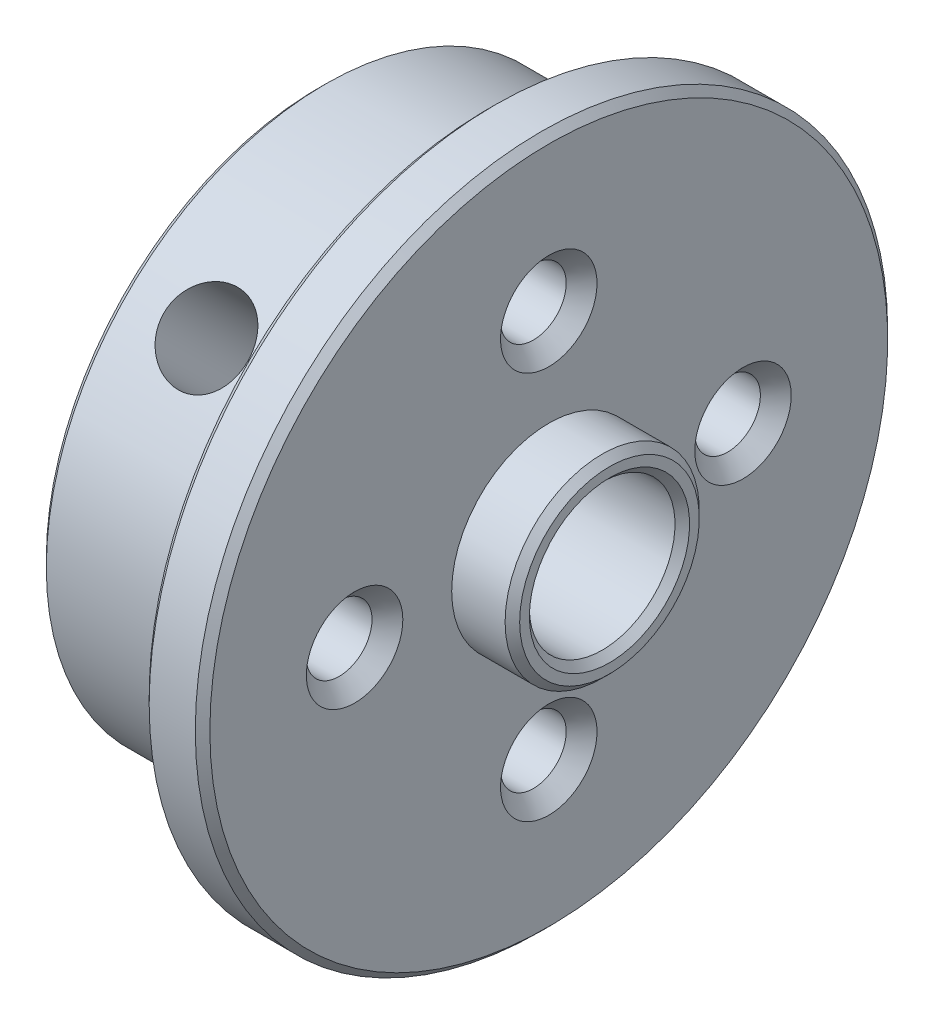
ISO-10303-21;
HEADER;
FILE_DESCRIPTION(('STEP AP214'),'2;1');
FILE_NAME('part.step','',(''),(''),'','','');
FILE_SCHEMA(('AUTOMOTIVE_DESIGN { 1 0 10303 214 1 1 1 1 }'));
ENDSEC;
DATA;
#1=APPLICATION_CONTEXT('core data for automotive mechanical design processes');
#2=APPLICATION_PROTOCOL_DEFINITION('international standard','automotive_design',2000,#1);
#3=PRODUCT_CONTEXT('',#1,'mechanical');
#4=PRODUCT('Part','Part','',(#3));
#5=PRODUCT_RELATED_PRODUCT_CATEGORY('part','',(#4));
#6=PRODUCT_DEFINITION_FORMATION('','',#4);
#7=PRODUCT_DEFINITION_CONTEXT('part definition',#1,'design');
#8=PRODUCT_DEFINITION('design','',#6,#7);
#9=PRODUCT_DEFINITION_SHAPE('','',#8);
#10=(LENGTH_UNIT() NAMED_UNIT(*) SI_UNIT(.MILLI.,.METRE.));
#11=(NAMED_UNIT(*) PLANE_ANGLE_UNIT() SI_UNIT($,.RADIAN.));
#12=(NAMED_UNIT(*) SI_UNIT($,.STERADIAN.) SOLID_ANGLE_UNIT());
#13=UNCERTAINTY_MEASURE_WITH_UNIT(LENGTH_MEASURE(1.E-05),#10,'distance_accuracy_value','');
#14=(GEOMETRIC_REPRESENTATION_CONTEXT(3) GLOBAL_UNCERTAINTY_ASSIGNED_CONTEXT((#13)) GLOBAL_UNIT_ASSIGNED_CONTEXT((#10,
#11,#12)) REPRESENTATION_CONTEXT('',''));
#15=CARTESIAN_POINT('',(0.,0.,0.));
#16=DIRECTION('',(0.,0.,1.));
#17=DIRECTION('',(1.,0.,0.));
#18=AXIS2_PLACEMENT_3D('',#15,#16,#17);
#19=CARTESIAN_POINT('',(0.,0.,0.));
#20=DIRECTION('',(-1.,0.,0.));
#21=DIRECTION('',(0.,0.,1.));
#22=AXIS2_PLACEMENT_3D('',#19,#20,#21);
#23=CYLINDRICAL_SURFACE('',#22,11.5);
#24=CARTESIAN_POINT('',(-9.19999999999999,0.,0.));
#25=DIRECTION('',(1.,0.,0.));
#26=DIRECTION('',(0.,0.,-1.));
#27=AXIS2_PLACEMENT_3D('',#24,#25,#26);
#28=CIRCLE('',#27,11.5);
#29=CARTESIAN_POINT('',(-9.19999999999999,0.,-11.5));
#30=VERTEX_POINT('',#29);
#31=EDGE_CURVE('E74',#30,#30,#28,.T.);
#32=ORIENTED_EDGE('',*,*,#31,.T.);
#33=EDGE_LOOP('',(#32));
#34=FACE_BOUND('',#33,.T.);
#35=CARTESIAN_POINT('',(-6.,6.81817458415801,9.26080424908883));
#36=CARTESIAN_POINT('',(-6.09642872764414,6.81817854052005,9.26080257448462));
#37=CARTESIAN_POINT('',(-6.19291339372761,6.8247808689419,9.2559516418585));
#38=CARTESIAN_POINT('',(-6.38318501015113,6.85093575108356,9.23660834611285));
#39=CARTESIAN_POINT('',(-6.47696923765206,6.87050092878717,9.22210658438797));
#40=CARTESIAN_POINT('',(-6.65905830324152,6.9217672746644,9.18368972584961));
#41=CARTESIAN_POINT('',(-6.74736729025288,6.95345911982339,9.15978186007717));
#42=CARTESIAN_POINT('',(-6.91612250146382,7.0277303954712,9.10292165669288));
#43=CARTESIAN_POINT('',(-6.99656980389278,7.07030833002896,9.0699705617266));
#44=CARTESIAN_POINT('',(-7.14797616114338,7.16510434376142,8.99527303043986));
#45=CARTESIAN_POINT('',(-7.21886296662692,7.21738942421794,8.95346516067613));
#46=CARTESIAN_POINT('',(-7.34851000060077,7.32951048541137,8.86191311272266));
#47=CARTESIAN_POINT('',(-7.40726956176326,7.38934688138393,8.81216849806331));
#48=CARTESIAN_POINT('',(-7.5112607451004,7.51480317326911,8.70543154314447));
#49=CARTESIAN_POINT('',(-7.55642583052685,7.5804495433012,8.64840544040237));
#50=CARTESIAN_POINT('',(-7.63151899232104,7.71506272430739,8.52853562820631));
#51=CARTESIAN_POINT('',(-7.66144787578985,7.78402935918657,8.46569222711816));
#52=CARTESIAN_POINT('',(-7.70500003067391,7.92252153425317,8.33622015234762));
#53=CARTESIAN_POINT('',(-7.71874428717648,7.99203896540362,8.26962351544998));
#54=CARTESIAN_POINT('',(-7.72991271218585,8.13001649549902,8.13401412124361));
#55=CARTESIAN_POINT('',(-7.72733779014373,8.1984766531516,8.06500149878844));
#56=CARTESIAN_POINT('',(-7.70603641544544,8.33184546073385,7.92713567360147));
#57=CARTESIAN_POINT('',(-7.68744012478527,8.39677826017712,7.85828565828065));
#58=CARTESIAN_POINT('',(-7.63482821321521,8.52201622930709,7.72229177081329));
#59=CARTESIAN_POINT('',(-7.60081219462002,8.58232127959409,7.65514794271764));
#60=CARTESIAN_POINT('',(-7.51819320731742,8.69713409078544,7.5244575289156));
#61=CARTESIAN_POINT('',(-7.46953545558073,8.75161901936677,7.46092553752131));
#62=CARTESIAN_POINT('',(-7.35905421677062,8.85341663204186,7.33984200058632));
#63=CARTESIAN_POINT('',(-7.29722986087831,8.9007288424798,7.28229085007381));
#64=CARTESIAN_POINT('',(-7.16144531959408,8.9877465578854,7.17462612799933));
#65=CARTESIAN_POINT('',(-7.08737149152437,9.02737246580495,7.12459148130544));
#66=CARTESIAN_POINT('',(-6.92957675970303,9.09776185387514,7.03448708690798));
#67=CARTESIAN_POINT('',(-6.84585579626062,9.12852527918584,6.99441740086653));
#68=CARTESIAN_POINT('',(-6.67102633346322,9.18072205025259,6.92576443147103));
#69=CARTESIAN_POINT('',(-6.57991210654787,9.20214807887082,6.89719015770043));
#70=CARTESIAN_POINT('',(-6.39294600484399,9.23530020275009,6.85273714683321));
#71=CARTESIAN_POINT('',(-6.29709446535216,9.24702698346388,6.83685751260003));
#72=CARTESIAN_POINT('',(-6.10437197370602,9.26053522455062,6.8185495150189));
#73=CARTESIAN_POINT('',(-6.00751997647464,9.26241221291593,6.81599194968309));
#74=CARTESIAN_POINT('',(-5.81467357929608,9.25644992403591,6.82408668552968));
#75=CARTESIAN_POINT('',(-5.71867915276177,9.24861094907319,6.83473857574009));
#76=CARTESIAN_POINT('',(-5.53076527363405,9.22340054231299,6.86872053260736));
#77=CARTESIAN_POINT('',(-5.4388277801321,9.20607717223097,6.8919866714389));
#78=CARTESIAN_POINT('',(-5.26106853223601,9.16219097675006,6.95022143341502));
#79=CARTESIAN_POINT('',(-5.17524708083541,9.13562769398149,6.9851906358504));
#80=CARTESIAN_POINT('',(-5.01144379266514,9.07343118554275,7.06579419519126));
#81=CARTESIAN_POINT('',(-4.93352602027353,9.03773101187161,7.11150706209449));
#82=CARTESIAN_POINT('',(-4.7884005011324,8.95793582389579,7.21175985366466));
#83=CARTESIAN_POINT('',(-4.72119336199644,8.91384033363655,7.26630027876491));
#84=CARTESIAN_POINT('',(-4.59882607416581,8.81762377083518,7.38276729982356));
#85=CARTESIAN_POINT('',(-4.54377124370924,8.76543873697966,7.4447517872899));
#86=CARTESIAN_POINT('',(-4.44800518892195,8.65435505315604,7.57359646785078));
#87=CARTESIAN_POINT('',(-4.40729357137407,8.59545658729433,7.64045652722155));
#88=CARTESIAN_POINT('',(-4.34153782425449,8.47250151284391,7.77657322760843));
#89=CARTESIAN_POINT('',(-4.31643613713192,8.40846484856458,7.84582005863276));
#90=CARTESIAN_POINT('',(-4.28242653707968,8.27666178943879,7.98473738812657));
#91=CARTESIAN_POINT('',(-4.27351755177161,8.20889564188749,8.05440785823349));
#92=CARTESIAN_POINT('',(-4.27217247399859,8.07219814790684,8.19139116449172));
#93=CARTESIAN_POINT('',(-4.27957524530074,8.00328481405845,8.25872044815867));
#94=CARTESIAN_POINT('',(-4.3102981211562,7.86568100847884,8.38988080610632));
#95=CARTESIAN_POINT('',(-4.33361817439202,7.79699053602984,8.45371189166454));
#96=CARTESIAN_POINT('',(-4.39545642865356,7.66201652661834,8.57623527885114));
#97=CARTESIAN_POINT('',(-4.43396344459169,7.59573125738638,8.63493132361557));
#98=CARTESIAN_POINT('',(-4.52506534771602,7.46764933071558,8.74593647008587));
#99=CARTESIAN_POINT('',(-4.57766069462073,7.40585281983378,8.79824536329052));
#100=CARTESIAN_POINT('',(-4.69602877486753,7.28826170649499,8.89590618386379));
#101=CARTESIAN_POINT('',(-4.76192046740779,7.23252882901332,8.94118826367201));
#102=CARTESIAN_POINT('',(-4.90476056175067,7.12969845020847,9.02339989152853));
#103=CARTESIAN_POINT('',(-4.98171155490582,7.08260297865642,9.06032747676423));
#104=CARTESIAN_POINT('',(-5.14499573665775,6.99857227843254,9.1253950430916));
#105=CARTESIAN_POINT('',(-5.23137934689139,6.96169579365216,9.15348433734684));
#106=CARTESIAN_POINT('',(-5.41068881345844,6.89994280655271,9.20012499066084));
#107=CARTESIAN_POINT('',(-5.50360776834516,6.87505385690361,9.21868624454205));
#108=CARTESIAN_POINT('',(-5.66411942162941,6.84390952320254,9.24181492529233));
#109=CARTESIAN_POINT('',(-5.73072099340234,6.83427846937976,9.24892979328969));
#110=CARTESIAN_POINT('',(-5.86487256078978,6.82140965514164,9.25842501116616));
#111=CARTESIAN_POINT('',(-5.93242254405105,6.81817181153114,9.260805422655));
#112=CARTESIAN_POINT('',(-6.,6.81817458415801,9.26080424908883));
#113=B_SPLINE_CURVE_WITH_KNOTS('',3,(#35,#36,#37,#38,#39,#40,#41,#42,#43,#44,#45,#46,#47,#48,
#49,#50,#51,#52,#53,#54,#55,#56,#57,#58,#59,#60,#61,#62,#63,#64,#65,#66,#67,#68,#69,#70,#71,#72,
#73,#74,#75,#76,#77,#78,#79,#80,#81,#82,#83,#84,#85,#86,#87,#88,#89,#90,#91,#92,#93,#94,#95,#96,
#97,#98,#99,#100,#101,#102,#103,#104,#105,#106,#107,#108,#109,#110,#111,#112),.UNSPECIFIED.,.T.,
.F.,(4,2,2,2,2,2,2,2,2,2,2,2,2,2,2,2,2,2,2,2,2,2,2,2,2,2,2,2,2,2,2,2,2,2,2,2,2,2,4),(0.,
0.289039178024996,0.578360253933015,0.867459344477231,1.15651872929524,1.44765292141547,
1.73880312955476,2.03135599910802,2.32389336976538,2.61422976390469,2.90454997803691,
3.19253355704969,3.48052456377762,3.76960679710975,4.05870811189724,4.35065980511372,
4.6426133048519,4.93479518080975,5.22695640630195,5.51627880464328,5.80559220182495,
6.0934529075039,6.38132786412921,6.67137574885808,6.96144008213262,7.25392733400486,
7.54640656675625,7.83780086279367,8.12917586023968,8.41768541569528,8.7061940409975,
8.99449057740371,9.28279652240498,9.57380637237164,9.86488452162263,10.1576027734458,
10.4500164206944,10.6525783229463,10.8551375892325),.UNSPECIFIED.);
#114=CARTESIAN_POINT('',(-6.,6.81817458415801,9.26080424908883));
#115=VERTEX_POINT('',#114);
#116=EDGE_CURVE('E89',#115,#115,#113,.T.);
#117=ORIENTED_EDGE('',*,*,#116,.T.);
#118=EDGE_LOOP('',(#117));
#119=FACE_BOUND('',#118,.T.);
#120=CARTESIAN_POINT('',(-2.5,0.,0.));
#121=DIRECTION('',(-1.,0.,0.));
#122=DIRECTION('',(0.,0.,1.));
#123=AXIS2_PLACEMENT_3D('',#120,#121,#122);
#124=CIRCLE('',#123,11.5);
#125=CARTESIAN_POINT('',(-2.5,0.,11.5));
#126=VERTEX_POINT('',#125);
#127=EDGE_CURVE('E96',#126,#126,#124,.T.);
#128=ORIENTED_EDGE('',*,*,#127,.T.);
#129=EDGE_LOOP('',(#128));
#130=FACE_BOUND('',#129,.T.);
#131=ADVANCED_FACE('F45',(#34,#119,#130),#23,.T.);
#132=CARTESIAN_POINT('',(-9.5,3.,0.));
#133=DIRECTION('',(1.,0.,0.));
#134=DIRECTION('',(0.,0.,-1.));
#135=AXIS2_PLACEMENT_3D('',#132,#133,#134);
#136=PLANE('',#135);
#137=CARTESIAN_POINT('',(-9.5,0.,0.));
#138=DIRECTION('',(1.,0.,0.));
#139=DIRECTION('',(0.,0.,-1.));
#140=AXIS2_PLACEMENT_3D('',#137,#138,#139);
#141=CIRCLE('',#140,3.3);
#142=CARTESIAN_POINT('',(-9.5,0.,-3.3));
#143=VERTEX_POINT('',#142);
#144=EDGE_CURVE('E77',#143,#143,#141,.T.);
#145=ORIENTED_EDGE('',*,*,#144,.T.);
#146=EDGE_LOOP('',(#145));
#147=FACE_BOUND('',#146,.T.);
#148=CARTESIAN_POINT('',(-9.5,0.,0.));
#149=DIRECTION('',(1.,0.,0.));
#150=DIRECTION('',(0.,0.,-1.));
#151=AXIS2_PLACEMENT_3D('',#148,#149,#150);
#152=CIRCLE('',#151,11.2);
#153=CARTESIAN_POINT('',(-9.5,0.,-11.2));
#154=VERTEX_POINT('',#153);
#155=EDGE_CURVE('E80',#154,#154,#152,.F.);
#156=ORIENTED_EDGE('',*,*,#155,.T.);
#157=EDGE_LOOP('',(#156));
#158=FACE_BOUND('',#157,.T.);
#159=CARTESIAN_POINT('',(-9.5,8.,0.));
#160=DIRECTION('',(1.,0.,0.));
#161=DIRECTION('',(0.,0.,-1.));
#162=AXIS2_PLACEMENT_3D('',#159,#160,#161);
#163=CIRCLE('',#162,1.98755);
#164=CARTESIAN_POINT('',(-9.5,8.,-1.98755));
#165=VERTEX_POINT('',#164);
#166=EDGE_CURVE('E117',#165,#165,#163,.T.);
#167=ORIENTED_EDGE('',*,*,#166,.T.);
#168=EDGE_LOOP('',(#167));
#169=FACE_BOUND('',#168,.T.);
#170=CARTESIAN_POINT('',(-9.5,-8.,0.));
#171=DIRECTION('',(1.,0.,0.));
#172=DIRECTION('',(0.,0.,-1.));
#173=AXIS2_PLACEMENT_3D('',#170,#171,#172);
#174=CIRCLE('',#173,1.98755);
#175=CARTESIAN_POINT('',(-9.5,-8.,-1.98755));
#176=VERTEX_POINT('',#175);
#177=EDGE_CURVE('E197',#176,#176,#174,.T.);
#178=ORIENTED_EDGE('',*,*,#177,.T.);
#179=EDGE_LOOP('',(#178));
#180=FACE_BOUND('',#179,.T.);
#181=CARTESIAN_POINT('',(-9.5,0.,-8.));
#182=DIRECTION('',(1.,0.,0.));
#183=DIRECTION('',(0.,0.,-1.));
#184=AXIS2_PLACEMENT_3D('',#181,#182,#183);
#185=CIRCLE('',#184,1.98755);
#186=CARTESIAN_POINT('',(-9.5,0.,-9.98755));
#187=VERTEX_POINT('',#186);
#188=EDGE_CURVE('E185',#187,#187,#185,.T.);
#189=ORIENTED_EDGE('',*,*,#188,.T.);
#190=EDGE_LOOP('',(#189));
#191=FACE_BOUND('',#190,.T.);
#192=CARTESIAN_POINT('',(-9.5,0.,8.));
#193=DIRECTION('',(1.,0.,0.));
#194=DIRECTION('',(0.,0.,-1.));
#195=AXIS2_PLACEMENT_3D('',#192,#193,#194);
#196=CIRCLE('',#195,1.98755);
#197=CARTESIAN_POINT('',(-9.5,0.,6.01245));
#198=VERTEX_POINT('',#197);
#199=EDGE_CURVE('E173',#198,#198,#196,.T.);
#200=ORIENTED_EDGE('',*,*,#199,.T.);
#201=EDGE_LOOP('',(#200));
#202=FACE_BOUND('',#201,.T.);
#203=ADVANCED_FACE('F142',(#147,#158,#169,#180,#191,#202),#136,.F.);
#204=CARTESIAN_POINT('',(-2.5,14.2621,0.));
#205=DIRECTION('',(1.,0.,0.));
#206=DIRECTION('',(0.,0.,-1.));
#207=AXIS2_PLACEMENT_3D('',#204,#205,#206);
#208=PLANE('',#207);
#209=CARTESIAN_POINT('',(-2.5,0.,0.));
#210=DIRECTION('',(1.,0.,0.));
#211=DIRECTION('',(0.,0.,-1.));
#212=AXIS2_PLACEMENT_3D('',#209,#210,#211);
#213=CIRCLE('',#212,13.9621);
#214=CARTESIAN_POINT('',(-2.5,0.,-13.9621));
#215=VERTEX_POINT('',#214);
#216=EDGE_CURVE('E71',#215,#215,#213,.F.);
#217=ORIENTED_EDGE('',*,*,#216,.T.);
#218=EDGE_LOOP('',(#217));
#219=FACE_BOUND('',#218,.T.);
#220=ORIENTED_EDGE('',*,*,#127,.F.);
#221=EDGE_LOOP('',(#220));
#222=FACE_BOUND('',#221,.T.);
#223=ADVANCED_FACE('F139',(#219,#222),#208,.F.);
#224=CARTESIAN_POINT('',(0.,0.,0.));
#225=DIRECTION('',(-1.,0.,0.));
#226=DIRECTION('',(0.,0.,1.));
#227=AXIS2_PLACEMENT_3D('',#224,#225,#226);
#228=CYLINDRICAL_SURFACE('',#227,14.2621);
#229=CARTESIAN_POINT('',(-2.19999999999999,0.,0.));
#230=DIRECTION('',(1.,0.,0.));
#231=DIRECTION('',(0.,0.,-1.));
#232=AXIS2_PLACEMENT_3D('',#229,#230,#231);
#233=CIRCLE('',#232,14.2621);
#234=CARTESIAN_POINT('',(-2.19999999999999,0.,-14.2621));
#235=VERTEX_POINT('',#234);
#236=EDGE_CURVE('E65',#235,#235,#233,.T.);
#237=ORIENTED_EDGE('',*,*,#236,.T.);
#238=EDGE_LOOP('',(#237));
#239=FACE_BOUND('',#238,.T.);
#240=CARTESIAN_POINT('',(-0.3,0.,0.));
#241=DIRECTION('',(-1.,0.,0.));
#242=DIRECTION('',(0.,0.,1.));
#243=AXIS2_PLACEMENT_3D('',#240,#241,#242);
#244=CIRCLE('',#243,14.2621);
#245=CARTESIAN_POINT('',(-0.3,0.,14.2621));
#246=VERTEX_POINT('',#245);
#247=EDGE_CURVE('E68',#246,#246,#244,.T.);
#248=ORIENTED_EDGE('',*,*,#247,.T.);
#249=EDGE_LOOP('',(#248));
#250=FACE_BOUND('',#249,.T.);
#251=ADVANCED_FACE('F136',(#239,#250),#228,.T.);
#252=CARTESIAN_POINT('',(0.,14.2621,0.));
#253=DIRECTION('',(-1.,0.,0.));
#254=DIRECTION('',(0.,0.,1.));
#255=AXIS2_PLACEMENT_3D('',#252,#253,#254);
#256=PLANE('',#255);
#257=CARTESIAN_POINT('',(0.,0.,0.));
#258=DIRECTION('',(-1.,0.,0.));
#259=DIRECTION('',(0.,0.,1.));
#260=AXIS2_PLACEMENT_3D('',#257,#258,#259);
#261=CIRCLE('',#260,13.9621);
#262=CARTESIAN_POINT('',(0.,0.,13.9621));
#263=VERTEX_POINT('',#262);
#264=EDGE_CURVE('E60',#263,#263,#261,.F.);
#265=ORIENTED_EDGE('',*,*,#264,.T.);
#266=EDGE_LOOP('',(#265));
#267=FACE_BOUND('',#266,.T.);
#268=CARTESIAN_POINT('',(0.,8.,0.));
#269=DIRECTION('',(1.,0.,0.));
#270=DIRECTION('',(0.,0.,-1.));
#271=AXIS2_PLACEMENT_3D('',#268,#269,#270);
#272=CIRCLE('',#271,1.98755);
#273=CARTESIAN_POINT('',(0.,8.,-1.98755));
#274=VERTEX_POINT('',#273);
#275=EDGE_CURVE('E205',#274,#274,#272,.T.);
#276=ORIENTED_EDGE('',*,*,#275,.F.);
#277=EDGE_LOOP('',(#276));
#278=FACE_BOUND('',#277,.T.);
#279=CARTESIAN_POINT('',(0.,-8.,0.));
#280=DIRECTION('',(1.,0.,0.));
#281=DIRECTION('',(0.,0.,-1.));
#282=AXIS2_PLACEMENT_3D('',#279,#280,#281);
#283=CIRCLE('',#282,1.98755);
#284=CARTESIAN_POINT('',(0.,-8.,-1.98755));
#285=VERTEX_POINT('',#284);
#286=EDGE_CURVE('E194',#285,#285,#283,.T.);
#287=ORIENTED_EDGE('',*,*,#286,.F.);
#288=EDGE_LOOP('',(#287));
#289=FACE_BOUND('',#288,.T.);
#290=CARTESIAN_POINT('',(0.,0.,-8.));
#291=DIRECTION('',(1.,0.,0.));
#292=DIRECTION('',(0.,0.,-1.));
#293=AXIS2_PLACEMENT_3D('',#290,#291,#292);
#294=CIRCLE('',#293,1.98755);
#295=CARTESIAN_POINT('',(0.,0.,-9.98755));
#296=VERTEX_POINT('',#295);
#297=EDGE_CURVE('E182',#296,#296,#294,.T.);
#298=ORIENTED_EDGE('',*,*,#297,.F.);
#299=EDGE_LOOP('',(#298));
#300=FACE_BOUND('',#299,.T.);
#301=CARTESIAN_POINT('',(0.,0.,8.));
#302=DIRECTION('',(1.,0.,0.));
#303=DIRECTION('',(0.,0.,-1.));
#304=AXIS2_PLACEMENT_3D('',#301,#302,#303);
#305=CIRCLE('',#304,1.98755);
#306=CARTESIAN_POINT('',(0.,0.,6.01245));
#307=VERTEX_POINT('',#306);
#308=EDGE_CURVE('E170',#307,#307,#305,.T.);
#309=ORIENTED_EDGE('',*,*,#308,.F.);
#310=EDGE_LOOP('',(#309));
#311=FACE_BOUND('',#310,.T.);
#312=CARTESIAN_POINT('',(0.,0.,0.));
#313=DIRECTION('',(-1.,0.,0.));
#314=DIRECTION('',(0.,0.,1.));
#315=AXIS2_PLACEMENT_3D('',#312,#313,#314);
#316=CIRCLE('',#315,4.);
#317=CARTESIAN_POINT('',(0.,0.,4.));
#318=VERTEX_POINT('',#317);
#319=EDGE_CURVE('E159',#318,#318,#316,.T.);
#320=ORIENTED_EDGE('',*,*,#319,.T.);
#321=EDGE_LOOP('',(#320));
#322=FACE_BOUND('',#321,.T.);
#323=ADVANCED_FACE('F133',(#267,#278,#289,#300,#311,#322),#256,.F.);
#324=CARTESIAN_POINT('',(0.,0.,0.));
#325=DIRECTION('',(-1.,0.,0.));
#326=DIRECTION('',(0.,0.,1.));
#327=AXIS2_PLACEMENT_3D('',#324,#325,#326);
#328=CYLINDRICAL_SURFACE('',#327,4.);
#329=CARTESIAN_POINT('',(2.20000000000001,0.,0.));
#330=DIRECTION('',(-1.,0.,0.));
#331=DIRECTION('',(0.,0.,1.));
#332=AXIS2_PLACEMENT_3D('',#329,#330,#331);
#333=CIRCLE('',#332,4.);
#334=CARTESIAN_POINT('',(2.20000000000001,0.,4.));
#335=VERTEX_POINT('',#334);
#336=EDGE_CURVE('E12',#335,#335,#333,.T.);
#337=ORIENTED_EDGE('',*,*,#336,.T.);
#338=EDGE_LOOP('',(#337));
#339=FACE_BOUND('',#338,.T.);
#340=ORIENTED_EDGE('',*,*,#319,.F.);
#341=EDGE_LOOP('',(#340));
#342=FACE_BOUND('',#341,.T.);
#343=ADVANCED_FACE('F130',(#339,#342),#328,.T.);
#344=CARTESIAN_POINT('',(2.5,3.,0.));
#345=DIRECTION('',(-1.,0.,0.));
#346=DIRECTION('',(0.,0.,1.));
#347=AXIS2_PLACEMENT_3D('',#344,#345,#346);
#348=PLANE('',#347);
#349=CARTESIAN_POINT('',(2.5,0.,0.));
#350=DIRECTION('',(-1.,0.,0.));
#351=DIRECTION('',(0.,0.,1.));
#352=AXIS2_PLACEMENT_3D('',#349,#350,#351);
#353=CIRCLE('',#352,3.3);
#354=CARTESIAN_POINT('',(2.5,0.,3.3));
#355=VERTEX_POINT('',#354);
#356=EDGE_CURVE('E52',#355,#355,#353,.T.);
#357=ORIENTED_EDGE('',*,*,#356,.T.);
#358=EDGE_LOOP('',(#357));
#359=FACE_BOUND('',#358,.T.);
#360=CARTESIAN_POINT('',(2.5,0.,0.));
#361=DIRECTION('',(-1.,0.,0.));
#362=DIRECTION('',(0.,0.,1.));
#363=AXIS2_PLACEMENT_3D('',#360,#361,#362);
#364=CIRCLE('',#363,3.70000000000001);
#365=CARTESIAN_POINT('',(2.5,0.,3.70000000000001));
#366=VERTEX_POINT('',#365);
#367=EDGE_CURVE('E56',#366,#366,#364,.F.);
#368=ORIENTED_EDGE('',*,*,#367,.T.);
#369=EDGE_LOOP('',(#368));
#370=FACE_BOUND('',#369,.T.);
#371=ADVANCED_FACE('F125',(#359,#370),#348,.F.);
#372=CARTESIAN_POINT('',(0.,0.,0.));
#373=DIRECTION('',(-1.,0.,0.));
#374=DIRECTION('',(0.,0.,1.));
#375=AXIS2_PLACEMENT_3D('',#372,#373,#374);
#376=CYLINDRICAL_SURFACE('',#375,3.);
#377=CARTESIAN_POINT('',(-9.2,0.,0.));
#378=DIRECTION('',(1.,0.,0.));
#379=DIRECTION('',(0.,0.,-1.));
#380=AXIS2_PLACEMENT_3D('',#377,#378,#379);
#381=CIRCLE('',#380,3.);
#382=CARTESIAN_POINT('',(-9.2,0.,-3.));
#383=VERTEX_POINT('',#382);
#384=EDGE_CURVE('E83',#383,#383,#381,.F.);
#385=ORIENTED_EDGE('',*,*,#384,.T.);
#386=EDGE_LOOP('',(#385));
#387=FACE_BOUND('',#386,.T.);
#388=CARTESIAN_POINT('',(2.2,0.,0.));
#389=DIRECTION('',(-1.,0.,0.));
#390=DIRECTION('',(0.,0.,1.));
#391=AXIS2_PLACEMENT_3D('',#388,#389,#390);
#392=CIRCLE('',#391,3.);
#393=CARTESIAN_POINT('',(2.2,0.,3.));
#394=VERTEX_POINT('',#393);
#395=EDGE_CURVE('E86',#394,#394,#392,.F.);
#396=ORIENTED_EDGE('',*,*,#395,.T.);
#397=EDGE_LOOP('',(#396));
#398=FACE_BOUND('',#397,.T.);
#399=CARTESIAN_POINT('',(-6.,0.513156291537535,2.95578595646834));
#400=CARTESIAN_POINT('',(-5.91226232935431,0.513158266195781,2.95578646892158));
#401=CARTESIAN_POINT('',(-5.824517092081,0.521291814886618,2.95440810821983));
#402=CARTESIAN_POINT('',(-5.65192166427408,0.552938322357687,2.9486444566044));
#403=CARTESIAN_POINT('',(-5.56707461102145,0.576467424256902,2.94425600920902));
#404=CARTESIAN_POINT('',(-5.40310959065357,0.636518990261702,2.93185360128813));
#405=CARTESIAN_POINT('',(-5.32395788153943,0.672955751110722,2.92386346187037));
#406=CARTESIAN_POINT('',(-5.17208293459383,0.756361355119584,2.90340456263083));
#407=CARTESIAN_POINT('',(-5.09936177530556,0.803333586429952,2.89093436126718));
#408=CARTESIAN_POINT('',(-4.95350070565705,0.911226564359177,2.85887587362854));
#409=CARTESIAN_POINT('',(-4.88121975837857,0.97311894367148,2.83864852387968));
#410=CARTESIAN_POINT('',(-4.7467210104847,1.10434858375482,2.79021714238959));
#411=CARTESIAN_POINT('',(-4.68450990512957,1.17369074720387,2.76200783755609));
#412=CARTESIAN_POINT('',(-4.56597564593263,1.32422016216967,2.6933104388433));
#413=CARTESIAN_POINT('',(-4.51080460680374,1.40590433337988,2.65189837973203));
#414=CARTESIAN_POINT('',(-4.41629258451342,1.57154505466445,2.55720856758604));
#415=CARTESIAN_POINT('',(-4.37693830639572,1.65549963269396,2.50394083874135));
#416=CARTESIAN_POINT('',(-4.31891225341963,1.814286864291,2.39102234484607));
#417=CARTESIAN_POINT('',(-4.29870507134296,1.88926362303653,2.33236903682294));
#418=CARTESIAN_POINT('',(-4.27439050182638,2.03463778669338,2.20668348252714));
#419=CARTESIAN_POINT('',(-4.27026950467854,2.10503901311367,2.13965836879128));
#420=CARTESIAN_POINT('',(-4.27788793384615,2.23085006689717,2.00765189246205));
#421=CARTESIAN_POINT('',(-4.28786617131446,2.28705349237523,1.94331452091875));
#422=CARTESIAN_POINT('',(-4.32010368629814,2.39241676322638,1.81202276450651));
#423=CARTESIAN_POINT('',(-4.34236386836758,2.44157608947199,1.74506818722027));
#424=CARTESIAN_POINT('',(-4.39843417683423,2.53259762653095,1.61016600069143));
#425=CARTESIAN_POINT('',(-4.43234041125853,2.5743945935608,1.54221478230328));
#426=CARTESIAN_POINT('',(-4.51047664998747,2.65020793007321,1.40795953045179));
#427=CARTESIAN_POINT('',(-4.55470964581421,2.6842220393035,1.3416559804654));
#428=CARTESIAN_POINT('',(-4.65796015368069,2.74840604651987,1.20522794159334));
#429=CARTESIAN_POINT('',(-4.71808849201126,2.77769505575697,1.13553013228606));
#430=CARTESIAN_POINT('',(-4.84854028969138,2.82826247703971,1.00298341370333));
#431=CARTESIAN_POINT('',(-4.91887633069087,2.84953088503805,0.940143126706234));
#432=CARTESIAN_POINT('',(-5.07630925341306,2.88707321869059,0.818097665382805));
#433=CARTESIAN_POINT('',(-5.16438404720166,2.90261611115637,0.759917626155645));
#434=CARTESIAN_POINT('',(-5.34996215555269,2.92709215428618,0.659413716316788));
#435=CARTESIAN_POINT('',(-5.44744824257235,2.93603713251813,0.617061539918702));
#436=CARTESIAN_POINT('',(-5.62582419797751,2.94737009018637,0.560043656159898));
#437=CARTESIAN_POINT('',(-5.70532515112768,2.95079717760339,0.541236460224079));
#438=CARTESIAN_POINT('',(-5.86639099754874,2.95512265083407,0.517116487362531));
#439=CARTESIAN_POINT('',(-5.94795377215546,2.95602353380211,0.511790384876632));
#440=CARTESIAN_POINT('',(-6.11083168206113,2.9554437029479,0.515124950732473));
#441=CARTESIAN_POINT('',(-6.19214660541515,2.9539613305855,0.523795359455976));
#442=CARTESIAN_POINT('',(-6.35218226754592,2.94838267589809,0.554321154008511));
#443=CARTESIAN_POINT('',(-6.43090104508262,2.9442844629631,0.576186277489684));
#444=CARTESIAN_POINT('',(-6.58474153671935,2.9328862612002,0.631648224853984));
#445=CARTESIAN_POINT('',(-6.65981582703572,2.92555252816646,0.665367909683631));
#446=CARTESIAN_POINT('',(-6.80431916009393,2.90695935860338,0.742398084716233));
#447=CARTESIAN_POINT('',(-6.87374591056705,2.89569833774337,0.78571244298702));
#448=CARTESIAN_POINT('',(-7.01736080126898,2.86615931332249,0.887925170911445));
#449=CARTESIAN_POINT('',(-7.09038028167892,2.84701871326194,0.948219642328696));
#450=CARTESIAN_POINT('',(-7.22665272202676,2.80103224829446,1.07650758759684));
#451=CARTESIAN_POINT('',(-7.289897304244,2.77417982957242,1.14450758002539));
#452=CARTESIAN_POINT('',(-7.41139292052022,2.7083726987371,1.29304866210574));
#453=CARTESIAN_POINT('',(-7.46843855737284,2.66844906098092,1.37415835923152));
#454=CARTESIAN_POINT('',(-7.56699296634492,2.57680916217415,1.53913294282834));
#455=CARTESIAN_POINT('',(-7.60851380990164,2.52510211398173,1.62299563325695));
#456=CARTESIAN_POINT('',(-7.67122949339574,2.41454481325899,1.78287500025072));
#457=CARTESIAN_POINT('',(-7.69379124255195,2.35660435871339,1.85897994107052));
#458=CARTESIAN_POINT('',(-7.72260808884183,2.23193674563489,2.00693399870249));
#459=CARTESIAN_POINT('',(-7.72887816155777,2.16521771584176,2.07878696457452));
#460=CARTESIAN_POINT('',(-7.72499195399032,2.03366651382967,2.2071785040246));
#461=CARTESIAN_POINT('',(-7.71670087087545,1.9695539127772,2.26452206977988));
#462=CARTESIAN_POINT('',(-7.68762194989945,1.8383928726074,2.37223771265456));
#463=CARTESIAN_POINT('',(-7.66683352043024,1.77134429464408,2.42260945959827));
#464=CARTESIAN_POINT('',(-7.61371579807554,1.63659253053449,2.51560545927194));
#465=CARTESIAN_POINT('',(-7.58139536472766,1.56888988561988,2.55823562169161));
#466=CARTESIAN_POINT('',(-7.50636950390151,1.43485386966717,2.63575354440198));
#467=CARTESIAN_POINT('',(-7.46366132339773,1.36852086668449,2.67063924751202));
#468=CARTESIAN_POINT('',(-7.36376741070167,1.23199895103149,2.73651884745753));
#469=CARTESIAN_POINT('',(-7.30550622603023,1.16218786484745,2.76666323193304));
#470=CARTESIAN_POINT('',(-7.17881072870711,1.02897838563483,2.81892451695466));
#471=CARTESIAN_POINT('',(-7.11036431017463,0.96558777657654,2.84103175562436));
#472=CARTESIAN_POINT('',(-6.9564735396965,0.841457646880449,2.88038679483843));
#473=CARTESIAN_POINT('',(-6.86999155668813,0.781745411923201,2.89685098591367));
#474=CARTESIAN_POINT('',(-6.68740344877031,0.677503067290164,2.92299384222449));
#475=CARTESIAN_POINT('',(-6.5913120178483,0.632950222866077,2.93268269176839));
#476=CARTESIAN_POINT('',(-6.41281132516323,0.570671523818876,2.94535672575513));
#477=CARTESIAN_POINT('',(-6.33175343791775,0.549280754538194,2.94932111304425));
#478=CARTESIAN_POINT('',(-6.16713079766004,0.520529721690699,2.95453402789623));
#479=CARTESIAN_POINT('',(-6.08356883115832,0.513154410704817,2.95578546836421));
#480=CARTESIAN_POINT('',(-6.,0.513156291537535,2.95578595646834));
#481=B_SPLINE_CURVE_WITH_KNOTS('',3,(#399,#400,#401,#402,#403,#404,#405,#406,#407,#408,#409,
#410,#411,#412,#413,#414,#415,#416,#417,#418,#419,#420,#421,#422,#423,#424,#425,#426,#427,#428,
#429,#430,#431,#432,#433,#434,#435,#436,#437,#438,#439,#440,#441,#442,#443,#444,#445,#446,#447,
#448,#449,#450,#451,#452,#453,#454,#455,#456,#457,#458,#459,#460,#461,#462,#463,#464,#465,#466,
#467,#468,#469,#470,#471,#472,#473,#474,#475,#476,#477,#478,#479,#480),.UNSPECIFIED.,.T.,.F.,(4,
2,2,2,2,2,2,2,2,2,2,2,2,2,2,2,2,2,2,2,2,2,2,2,2,2,2,2,2,2,2,2,2,2,2,2,2,2,2,2,4),(0.,
0.262863347498756,0.526002764919042,0.787426784319768,1.04893499712955,1.33962728932968,
1.63051207077494,1.94954197447555,2.26830315032207,2.55854546573899,2.84854216851296,
3.10534984685796,3.36217644138047,3.62117552903758,3.88024973850414,4.16887183597505,
4.45785274862822,4.77631960528617,5.09421417442002,5.33844446100278,5.58243324057435,
5.82659188880224,6.07093094597332,6.31788085386139,6.56493050074796,6.85360499486601,
7.14252554589164,7.46152589712982,7.78027768850507,8.07337623726601,8.36620526945491,
8.62420232001307,8.88221158477688,9.14002305752314,9.39790293166685,9.68413390810054,
9.97070784887139,10.2882594705061,10.6053327345746,10.8559754277832,11.1063488710621),.UNSPECIFIED.);
#482=CARTESIAN_POINT('',(-6.,0.513156291537535,2.95578595646834));
#483=VERTEX_POINT('',#482);
#484=EDGE_CURVE('E111',#483,#483,#481,.T.);
#485=ORIENTED_EDGE('',*,*,#484,.T.);
#486=EDGE_LOOP('',(#485));
#487=FACE_BOUND('',#486,.T.);
#488=ADVANCED_FACE('F119',(#387,#398,#487),#376,.F.);
#489=CARTESIAN_POINT('',(-8.865,0.,8.));
#490=DIRECTION('',(-1.,0.,0.));
#491=DIRECTION('',(0.,0.,1.));
#492=AXIS2_PLACEMENT_3D('',#489,#490,#491);
#493=CONICAL_SURFACE('',#492,1.35255,0.785398163397447);
#494=ORIENTED_EDGE('',*,*,#199,.F.);
#495=EDGE_LOOP('',(#494));
#496=FACE_BOUND('',#495,.T.);
#497=CARTESIAN_POINT('',(-8.865,0.,8.));
#498=DIRECTION('',(1.,0.,0.));
#499=DIRECTION('',(0.,0.,-1.));
#500=AXIS2_PLACEMENT_3D('',#497,#498,#499);
#501=CIRCLE('',#500,1.35255);
#502=CARTESIAN_POINT('',(-8.865,0.,6.64745));
#503=VERTEX_POINT('',#502);
#504=EDGE_CURVE('E161',#503,#503,#501,.T.);
#505=ORIENTED_EDGE('',*,*,#504,.T.);
#506=EDGE_LOOP('',(#505));
#507=FACE_BOUND('',#506,.T.);
#508=ADVANCED_FACE('F124',(#496,#507),#493,.F.);
#509=CARTESIAN_POINT('',(0.,0.,8.));
#510=DIRECTION('',(1.,0.,0.));
#511=DIRECTION('',(0.,0.,-1.));
#512=AXIS2_PLACEMENT_3D('',#509,#510,#511);
#513=CYLINDRICAL_SURFACE('',#512,1.35255);
#514=ORIENTED_EDGE('',*,*,#504,.F.);
#515=EDGE_LOOP('',(#514));
#516=FACE_BOUND('',#515,.T.);
#517=CARTESIAN_POINT('',(-0.635,0.,8.));
#518=DIRECTION('',(1.,0.,0.));
#519=DIRECTION('',(0.,0.,-1.));
#520=AXIS2_PLACEMENT_3D('',#517,#518,#519);
#521=CIRCLE('',#520,1.35255);
#522=CARTESIAN_POINT('',(-0.635,0.,6.64745));
#523=VERTEX_POINT('',#522);
#524=EDGE_CURVE('E165',#523,#523,#521,.T.);
#525=ORIENTED_EDGE('',*,*,#524,.T.);
#526=EDGE_LOOP('',(#525));
#527=FACE_BOUND('',#526,.T.);
#528=ADVANCED_FACE('F372',(#516,#527),#513,.F.);
#529=CARTESIAN_POINT('',(0.,0.,8.));
#530=DIRECTION('',(1.,0.,0.));
#531=DIRECTION('',(0.,0.,-1.));
#532=AXIS2_PLACEMENT_3D('',#529,#530,#531);
#533=CONICAL_SURFACE('',#532,1.98755,0.785398163397446);
#534=ORIENTED_EDGE('',*,*,#524,.F.);
#535=EDGE_LOOP('',(#534));
#536=FACE_BOUND('',#535,.T.);
#537=ORIENTED_EDGE('',*,*,#308,.T.);
#538=EDGE_LOOP('',(#537));
#539=FACE_BOUND('',#538,.T.);
#540=ADVANCED_FACE('F363',(#536,#539),#533,.F.);
#541=CARTESIAN_POINT('',(-8.865,0.,-8.));
#542=DIRECTION('',(-1.,0.,0.));
#543=DIRECTION('',(0.,0.,1.));
#544=AXIS2_PLACEMENT_3D('',#541,#542,#543);
#545=CONICAL_SURFACE('',#544,1.35255,0.785398163397447);
#546=ORIENTED_EDGE('',*,*,#188,.F.);
#547=EDGE_LOOP('',(#546));
#548=FACE_BOUND('',#547,.T.);
#549=CARTESIAN_POINT('',(-8.865,0.,-8.));
#550=DIRECTION('',(1.,0.,0.));
#551=DIRECTION('',(0.,0.,-1.));
#552=AXIS2_PLACEMENT_3D('',#549,#550,#551);
#553=CIRCLE('',#552,1.35255);
#554=CARTESIAN_POINT('',(-8.865,0.,-9.35255));
#555=VERTEX_POINT('',#554);
#556=EDGE_CURVE('E176',#555,#555,#553,.T.);
#557=ORIENTED_EDGE('',*,*,#556,.T.);
#558=EDGE_LOOP('',(#557));
#559=FACE_BOUND('',#558,.T.);
#560=ADVANCED_FACE('F354',(#548,#559),#545,.F.);
#561=CARTESIAN_POINT('',(0.,0.,-8.));
#562=DIRECTION('',(1.,0.,0.));
#563=DIRECTION('',(0.,0.,-1.));
#564=AXIS2_PLACEMENT_3D('',#561,#562,#563);
#565=CYLINDRICAL_SURFACE('',#564,1.35255);
#566=ORIENTED_EDGE('',*,*,#556,.F.);
#567=EDGE_LOOP('',(#566));
#568=FACE_BOUND('',#567,.T.);
#569=CARTESIAN_POINT('',(-0.635,0.,-8.));
#570=DIRECTION('',(1.,0.,0.));
#571=DIRECTION('',(0.,0.,-1.));
#572=AXIS2_PLACEMENT_3D('',#569,#570,#571);
#573=CIRCLE('',#572,1.35255);
#574=CARTESIAN_POINT('',(-0.635,0.,-9.35255));
#575=VERTEX_POINT('',#574);
#576=EDGE_CURVE('E179',#575,#575,#573,.T.);
#577=ORIENTED_EDGE('',*,*,#576,.T.);
#578=EDGE_LOOP('',(#577));
#579=FACE_BOUND('',#578,.T.);
#580=ADVANCED_FACE('F345',(#568,#579),#565,.F.);
#581=CARTESIAN_POINT('',(0.,0.,-8.));
#582=DIRECTION('',(1.,0.,0.));
#583=DIRECTION('',(0.,0.,-1.));
#584=AXIS2_PLACEMENT_3D('',#581,#582,#583);
#585=CONICAL_SURFACE('',#584,1.98755,0.785398163397446);
#586=ORIENTED_EDGE('',*,*,#576,.F.);
#587=EDGE_LOOP('',(#586));
#588=FACE_BOUND('',#587,.T.);
#589=ORIENTED_EDGE('',*,*,#297,.T.);
#590=EDGE_LOOP('',(#589));
#591=FACE_BOUND('',#590,.T.);
#592=ADVANCED_FACE('F336',(#588,#591),#585,.F.);
#593=CARTESIAN_POINT('',(-8.865,-8.,0.));
#594=DIRECTION('',(-1.,0.,0.));
#595=DIRECTION('',(0.,0.,1.));
#596=AXIS2_PLACEMENT_3D('',#593,#594,#595);
#597=CONICAL_SURFACE('',#596,1.35255,0.785398163397447);
#598=ORIENTED_EDGE('',*,*,#177,.F.);
#599=EDGE_LOOP('',(#598));
#600=FACE_BOUND('',#599,.T.);
#601=CARTESIAN_POINT('',(-8.865,-8.,0.));
#602=DIRECTION('',(1.,0.,0.));
#603=DIRECTION('',(0.,0.,-1.));
#604=AXIS2_PLACEMENT_3D('',#601,#602,#603);
#605=CIRCLE('',#604,1.35255);
#606=CARTESIAN_POINT('',(-8.865,-8.,-1.35255));
#607=VERTEX_POINT('',#606);
#608=EDGE_CURVE('E188',#607,#607,#605,.T.);
#609=ORIENTED_EDGE('',*,*,#608,.T.);
#610=EDGE_LOOP('',(#609));
#611=FACE_BOUND('',#610,.T.);
#612=ADVANCED_FACE('F327',(#600,#611),#597,.F.);
#613=CARTESIAN_POINT('',(0.,-8.,0.));
#614=DIRECTION('',(1.,0.,0.));
#615=DIRECTION('',(0.,0.,-1.));
#616=AXIS2_PLACEMENT_3D('',#613,#614,#615);
#617=CYLINDRICAL_SURFACE('',#616,1.35255);
#618=ORIENTED_EDGE('',*,*,#608,.F.);
#619=EDGE_LOOP('',(#618));
#620=FACE_BOUND('',#619,.T.);
#621=CARTESIAN_POINT('',(-0.635,-8.,0.));
#622=DIRECTION('',(1.,0.,0.));
#623=DIRECTION('',(0.,0.,-1.));
#624=AXIS2_PLACEMENT_3D('',#621,#622,#623);
#625=CIRCLE('',#624,1.35255);
#626=CARTESIAN_POINT('',(-0.635,-8.,-1.35255));
#627=VERTEX_POINT('',#626);
#628=EDGE_CURVE('E191',#627,#627,#625,.T.);
#629=ORIENTED_EDGE('',*,*,#628,.T.);
#630=EDGE_LOOP('',(#629));
#631=FACE_BOUND('',#630,.T.);
#632=ADVANCED_FACE('F318',(#620,#631),#617,.F.);
#633=CARTESIAN_POINT('',(0.,-8.,0.));
#634=DIRECTION('',(1.,0.,0.));
#635=DIRECTION('',(0.,0.,-1.));
#636=AXIS2_PLACEMENT_3D('',#633,#634,#635);
#637=CONICAL_SURFACE('',#636,1.98755,0.785398163397446);
#638=ORIENTED_EDGE('',*,*,#628,.F.);
#639=EDGE_LOOP('',(#638));
#640=FACE_BOUND('',#639,.T.);
#641=ORIENTED_EDGE('',*,*,#286,.T.);
#642=EDGE_LOOP('',(#641));
#643=FACE_BOUND('',#642,.T.);
#644=ADVANCED_FACE('F218',(#640,#643),#637,.F.);
#645=CARTESIAN_POINT('',(-8.865,8.,0.));
#646=DIRECTION('',(-1.,0.,0.));
#647=DIRECTION('',(0.,0.,1.));
#648=AXIS2_PLACEMENT_3D('',#645,#646,#647);
#649=CONICAL_SURFACE('',#648,1.35255,0.785398163397447);
#650=ORIENTED_EDGE('',*,*,#166,.F.);
#651=EDGE_LOOP('',(#650));
#652=FACE_BOUND('',#651,.T.);
#653=CARTESIAN_POINT('',(-8.865,8.,0.));
#654=DIRECTION('',(1.,0.,0.));
#655=DIRECTION('',(0.,0.,-1.));
#656=AXIS2_PLACEMENT_3D('',#653,#654,#655);
#657=CIRCLE('',#656,1.35255);
#658=CARTESIAN_POINT('',(-8.865,8.,-1.35255));
#659=VERTEX_POINT('',#658);
#660=EDGE_CURVE('E200',#659,#659,#657,.T.);
#661=ORIENTED_EDGE('',*,*,#660,.T.);
#662=EDGE_LOOP('',(#661));
#663=FACE_BOUND('',#662,.T.);
#664=ADVANCED_FACE('F214',(#652,#663),#649,.F.);
#665=CARTESIAN_POINT('',(0.,8.,0.));
#666=DIRECTION('',(1.,0.,0.));
#667=DIRECTION('',(0.,0.,-1.));
#668=AXIS2_PLACEMENT_3D('',#665,#666,#667);
#669=CYLINDRICAL_SURFACE('',#668,1.35255);
#670=ORIENTED_EDGE('',*,*,#660,.F.);
#671=EDGE_LOOP('',(#670));
#672=FACE_BOUND('',#671,.T.);
#673=CARTESIAN_POINT('',(-0.635,8.,0.));
#674=DIRECTION('',(1.,0.,0.));
#675=DIRECTION('',(0.,0.,-1.));
#676=AXIS2_PLACEMENT_3D('',#673,#674,#675);
#677=CIRCLE('',#676,1.35255);
#678=CARTESIAN_POINT('',(-0.635,8.,-1.35255));
#679=VERTEX_POINT('',#678);
#680=EDGE_CURVE('E203',#679,#679,#677,.T.);
#681=ORIENTED_EDGE('',*,*,#680,.T.);
#682=EDGE_LOOP('',(#681));
#683=FACE_BOUND('',#682,.T.);
#684=ADVANCED_FACE('F217',(#672,#683),#669,.F.);
#685=CARTESIAN_POINT('',(0.,8.,0.));
#686=DIRECTION('',(1.,0.,0.));
#687=DIRECTION('',(0.,0.,-1.));
#688=AXIS2_PLACEMENT_3D('',#685,#686,#687);
#689=CONICAL_SURFACE('',#688,1.98755,0.785398163397447);
#690=ORIENTED_EDGE('',*,*,#680,.F.);
#691=EDGE_LOOP('',(#690));
#692=FACE_BOUND('',#691,.T.);
#693=ORIENTED_EDGE('',*,*,#275,.T.);
#694=EDGE_LOOP('',(#693));
#695=FACE_BOUND('',#694,.T.);
#696=ADVANCED_FACE('F106',(#692,#695),#689,.F.);
#697=CARTESIAN_POINT('',(-6.,8.13172798364529,8.13172798364531));
#698=DIRECTION('',(0.,0.707106781186546,0.707106781186549));
#699=DIRECTION('',(0.,-0.707106781186549,0.707106781186546));
#700=AXIS2_PLACEMENT_3D('',#697,#698,#699);
#701=CYLINDRICAL_SURFACE('',#700,1.72719999999999);
#702=ORIENTED_EDGE('',*,*,#116,.F.);
#703=EDGE_LOOP('',(#702));
#704=FACE_BOUND('',#703,.T.);
#705=ORIENTED_EDGE('',*,*,#484,.F.);
#706=EDGE_LOOP('',(#705));
#707=FACE_BOUND('',#706,.T.);
#708=ADVANCED_FACE('F101',(#704,#707),#701,.F.);
#709=CARTESIAN_POINT('',(-9.2,0.,0.));
#710=DIRECTION('',(-1.,0.,0.));
#711=DIRECTION('',(0.,0.,1.));
#712=AXIS2_PLACEMENT_3D('',#709,#710,#711);
#713=CONICAL_SURFACE('',#712,3.,0.785398163397453);
#714=ORIENTED_EDGE('',*,*,#144,.F.);
#715=EDGE_LOOP('',(#714));
#716=FACE_BOUND('',#715,.T.);
#717=ORIENTED_EDGE('',*,*,#384,.F.);
#718=EDGE_LOOP('',(#717));
#719=FACE_BOUND('',#718,.T.);
#720=ADVANCED_FACE('F105',(#716,#719),#713,.F.);
#721=CARTESIAN_POINT('',(-9.5,0.,0.));
#722=DIRECTION('',(1.,0.,0.));
#723=DIRECTION('',(0.,0.,-1.));
#724=AXIS2_PLACEMENT_3D('',#721,#722,#723);
#725=CONICAL_SURFACE('',#724,11.2,0.785398163397437);
#726=ORIENTED_EDGE('',*,*,#31,.F.);
#727=EDGE_LOOP('',(#726));
#728=FACE_BOUND('',#727,.T.);
#729=ORIENTED_EDGE('',*,*,#155,.F.);
#730=EDGE_LOOP('',(#729));
#731=FACE_BOUND('',#730,.T.);
#732=ADVANCED_FACE('F241',(#728,#731),#725,.T.);
#733=CARTESIAN_POINT('',(-2.5,0.,0.));
#734=DIRECTION('',(1.,0.,0.));
#735=DIRECTION('',(0.,0.,-1.));
#736=AXIS2_PLACEMENT_3D('',#733,#734,#735);
#737=CONICAL_SURFACE('',#736,13.9621,0.785398163397445);
#738=ORIENTED_EDGE('',*,*,#236,.F.);
#739=EDGE_LOOP('',(#738));
#740=FACE_BOUND('',#739,.T.);
#741=ORIENTED_EDGE('',*,*,#216,.F.);
#742=EDGE_LOOP('',(#741));
#743=FACE_BOUND('',#742,.T.);
#744=ADVANCED_FACE('F250',(#740,#743),#737,.T.);
#745=CARTESIAN_POINT('',(-0.3,0.,0.));
#746=DIRECTION('',(-1.,0.,0.));
#747=DIRECTION('',(0.,0.,1.));
#748=AXIS2_PLACEMENT_3D('',#745,#746,#747);
#749=CONICAL_SURFACE('',#748,14.2621,0.785398163397448);
#750=ORIENTED_EDGE('',*,*,#264,.F.);
#751=EDGE_LOOP('',(#750));
#752=FACE_BOUND('',#751,.T.);
#753=ORIENTED_EDGE('',*,*,#247,.F.);
#754=EDGE_LOOP('',(#753));
#755=FACE_BOUND('',#754,.T.);
#756=ADVANCED_FACE('F258',(#752,#755),#749,.T.);
#757=CARTESIAN_POINT('',(2.5,0.,0.));
#758=DIRECTION('',(1.,0.,0.));
#759=DIRECTION('',(0.,0.,-1.));
#760=AXIS2_PLACEMENT_3D('',#757,#758,#759);
#761=CONICAL_SURFACE('',#760,3.3,0.785398163397443);
#762=ORIENTED_EDGE('',*,*,#395,.F.);
#763=EDGE_LOOP('',(#762));
#764=FACE_BOUND('',#763,.T.);
#765=ORIENTED_EDGE('',*,*,#356,.F.);
#766=EDGE_LOOP('',(#765));
#767=FACE_BOUND('',#766,.T.);
#768=ADVANCED_FACE('F266',(#764,#767),#761,.F.);
#769=CARTESIAN_POINT('',(2.20000000000001,0.,0.));
#770=DIRECTION('',(-1.,0.,0.));
#771=DIRECTION('',(0.,0.,1.));
#772=AXIS2_PLACEMENT_3D('',#769,#770,#771);
#773=CONICAL_SURFACE('',#772,4.,0.785398163397445);
#774=ORIENTED_EDGE('',*,*,#367,.F.);
#775=EDGE_LOOP('',(#774));
#776=FACE_BOUND('',#775,.T.);
#777=ORIENTED_EDGE('',*,*,#336,.F.);
#778=EDGE_LOOP('',(#777));
#779=FACE_BOUND('',#778,.T.);
#780=ADVANCED_FACE('F47',(#776,#779),#773,.T.);
#781=CLOSED_SHELL('',(#131,#203,#223,#251,#323,#343,#371,#488,#508,#528,#540,#560,#580,#592,
#612,#632,#644,#664,#684,#696,#708,#720,#732,#744,#756,#768,#780));
#782=MANIFOLD_SOLID_BREP('B2',#781);
#783=ADVANCED_BREP_SHAPE_REPRESENTATION('',(#18,#782),#14);
#784=SHAPE_DEFINITION_REPRESENTATION(#9,#783);
ENDSEC;
END-ISO-10303-21;
